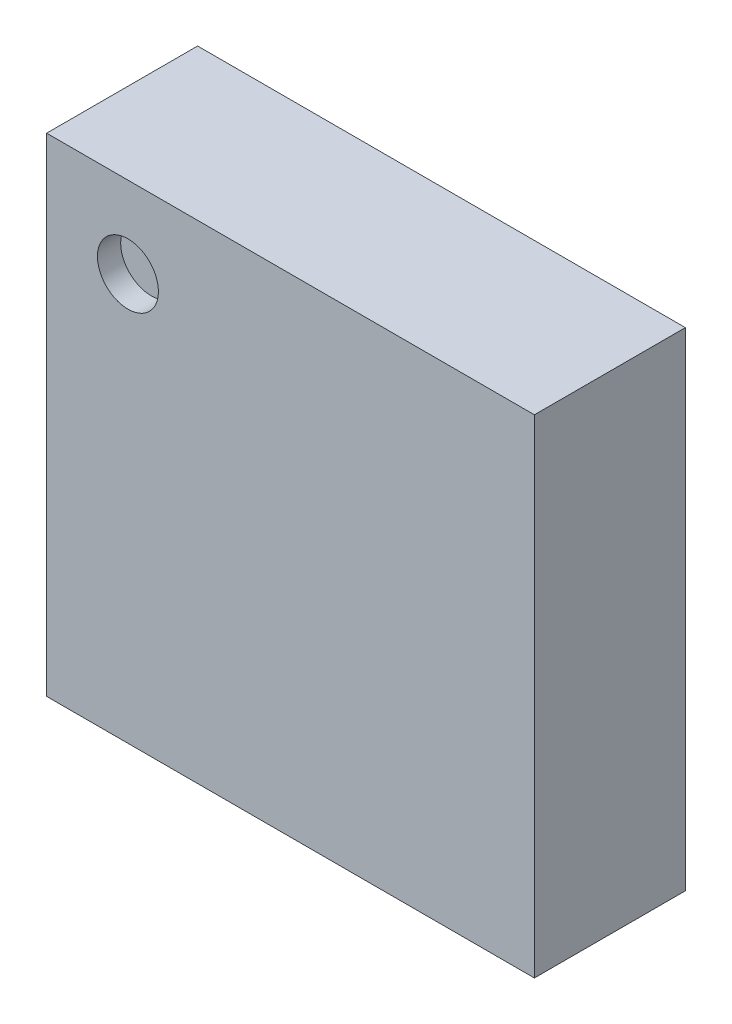
ISO-10303-21;
HEADER;
FILE_DESCRIPTION(('STEP AP214'),'2;1');
FILE_NAME('part.step','',(''),(''),'','','');
FILE_SCHEMA(('AUTOMOTIVE_DESIGN { 1 0 10303 214 1 1 1 1 }'));
ENDSEC;
DATA;
#1=APPLICATION_CONTEXT('core data for automotive mechanical design processes');
#2=APPLICATION_PROTOCOL_DEFINITION('international standard','automotive_design',2000,#1);
#3=PRODUCT_CONTEXT('',#1,'mechanical');
#4=PRODUCT('Part','Part','',(#3));
#5=PRODUCT_RELATED_PRODUCT_CATEGORY('part','',(#4));
#6=PRODUCT_DEFINITION_FORMATION('','',#4);
#7=PRODUCT_DEFINITION_CONTEXT('part definition',#1,'design');
#8=PRODUCT_DEFINITION('design','',#6,#7);
#9=PRODUCT_DEFINITION_SHAPE('','',#8);
#10=(LENGTH_UNIT() NAMED_UNIT(*) SI_UNIT(.MILLI.,.METRE.));
#11=(NAMED_UNIT(*) PLANE_ANGLE_UNIT() SI_UNIT($,.RADIAN.));
#12=(NAMED_UNIT(*) SI_UNIT($,.STERADIAN.) SOLID_ANGLE_UNIT());
#13=UNCERTAINTY_MEASURE_WITH_UNIT(LENGTH_MEASURE(1.E-05),#10,'distance_accuracy_value','');
#14=(GEOMETRIC_REPRESENTATION_CONTEXT(3) GLOBAL_UNCERTAINTY_ASSIGNED_CONTEXT((#13)) GLOBAL_UNIT_ASSIGNED_CONTEXT((#10,
#11,#12)) REPRESENTATION_CONTEXT('',''));
#15=CARTESIAN_POINT('',(0.,0.,0.));
#16=DIRECTION('',(0.,0.,1.));
#17=DIRECTION('',(1.,0.,0.));
#18=AXIS2_PLACEMENT_3D('',#15,#16,#17);
#19=CARTESIAN_POINT('',(0.35,1.75,0.55));
#20=DIRECTION('',(0.,0.,1.));
#21=DIRECTION('',(1.,0.,0.));
#22=AXIS2_PLACEMENT_3D('',#19,#20,#21);
#23=PLANE('',#22);
#24=CARTESIAN_POINT('',(0.35,1.75,0.55));
#25=DIRECTION('',(0.,0.,1.));
#26=DIRECTION('',(1.,0.,0.));
#27=AXIS2_PLACEMENT_3D('',#24,#25,#26);
#28=CIRCLE('',#27,0.13125);
#29=CARTESIAN_POINT('',(0.21875,1.75,0.55));
#30=VERTEX_POINT('',#29);
#31=EDGE_CURVE('E27',#30,#30,#28,.T.);
#32=ORIENTED_EDGE('',*,*,#31,.T.);
#33=EDGE_LOOP('',(#32));
#34=FACE_BOUND('',#33,.T.);
#35=ADVANCED_FACE('F16',(#34),#23,.T.);
#36=CARTESIAN_POINT('',(0.35,1.75,0.55));
#37=DIRECTION('',(0.,0.,1.));
#38=DIRECTION('',(1.,0.,0.));
#39=AXIS2_PLACEMENT_3D('',#36,#37,#38);
#40=CYLINDRICAL_SURFACE('',#39,0.13125);
#41=ORIENTED_EDGE('',*,*,#31,.F.);
#42=DIRECTION('',(0.,0.,1.));
#43=VECTOR('',#42,1.);
#44=CARTESIAN_POINT('',(0.21875,1.75,0.55));
#45=LINE('',#44,#43);
#46=CARTESIAN_POINT('',(0.21875,1.75,0.65));
#47=VERTEX_POINT('',#46);
#48=EDGE_CURVE('E11',#30,#47,#45,.T.);
#49=ORIENTED_EDGE('',*,*,#48,.T.);
#50=CARTESIAN_POINT('',(0.35,1.75,0.65));
#51=DIRECTION('',(0.,0.,1.));
#52=DIRECTION('',(1.,0.,0.));
#53=AXIS2_PLACEMENT_3D('',#50,#51,#52);
#54=CIRCLE('',#53,0.13125);
#55=EDGE_CURVE('E133',#47,#47,#54,.T.);
#56=ORIENTED_EDGE('',*,*,#55,.T.);
#57=ORIENTED_EDGE('',*,*,#48,.F.);
#58=EDGE_LOOP('',(#41,#49,#56,#57));
#59=FACE_BOUND('',#58,.T.);
#60=ADVANCED_FACE('F152',(#59),#40,.F.);
#61=CARTESIAN_POINT('',(2.1,0.,0.));
#62=DIRECTION('',(1.,0.,0.));
#63=DIRECTION('',(0.,1.,0.));
#64=AXIS2_PLACEMENT_3D('',#61,#62,#63);
#65=PLANE('',#64);
#66=DIRECTION('',(0.,0.,1.));
#67=VECTOR('',#66,1.);
#68=CARTESIAN_POINT('',(2.1,0.,0.));
#69=LINE('',#68,#67);
#70=CARTESIAN_POINT('',(2.1,0.,0.));
#71=VERTEX_POINT('',#70);
#72=CARTESIAN_POINT('',(2.1,0.,0.65));
#73=VERTEX_POINT('',#72);
#74=EDGE_CURVE('E88',#71,#73,#69,.T.);
#75=ORIENTED_EDGE('',*,*,#74,.F.);
#76=DIRECTION('',(0.,1.,0.));
#77=VECTOR('',#76,1.);
#78=CARTESIAN_POINT('',(2.1,0.,0.));
#79=LINE('',#78,#77);
#80=CARTESIAN_POINT('',(2.1,2.1,0.));
#81=VERTEX_POINT('',#80);
#82=EDGE_CURVE('E74',#71,#81,#79,.T.);
#83=ORIENTED_EDGE('',*,*,#82,.T.);
#84=DIRECTION('',(0.,0.,1.));
#85=VECTOR('',#84,1.);
#86=CARTESIAN_POINT('',(2.1,2.1,0.));
#87=LINE('',#86,#85);
#88=CARTESIAN_POINT('',(2.1,2.1,0.65));
#89=VERTEX_POINT('',#88);
#90=EDGE_CURVE('E85',#81,#89,#87,.T.);
#91=ORIENTED_EDGE('',*,*,#90,.T.);
#92=DIRECTION('',(0.,1.,0.));
#93=VECTOR('',#92,1.);
#94=CARTESIAN_POINT('',(2.1,0.,0.65));
#95=LINE('',#94,#93);
#96=EDGE_CURVE('E90',#73,#89,#95,.T.);
#97=ORIENTED_EDGE('',*,*,#96,.F.);
#98=EDGE_LOOP('',(#75,#83,#91,#97));
#99=FACE_BOUND('',#98,.T.);
#100=ADVANCED_FACE('F18',(#99),#65,.T.);
#101=CARTESIAN_POINT('',(0.,0.,0.));
#102=DIRECTION('',(0.,0.,1.));
#103=DIRECTION('',(1.,0.,0.));
#104=AXIS2_PLACEMENT_3D('',#101,#102,#103);
#105=PLANE('',#104);
#106=DIRECTION('',(0.,1.,0.));
#107=VECTOR('',#106,1.);
#108=CARTESIAN_POINT('',(0.,0.,0.));
#109=LINE('',#108,#107);
#110=CARTESIAN_POINT('',(0.,0.,0.));
#111=VERTEX_POINT('',#110);
#112=CARTESIAN_POINT('',(0.,2.1,0.));
#113=VERTEX_POINT('',#112);
#114=EDGE_CURVE('E100',#111,#113,#109,.T.);
#115=ORIENTED_EDGE('',*,*,#114,.T.);
#116=DIRECTION('',(1.,0.,0.));
#117=VECTOR('',#116,1.);
#118=CARTESIAN_POINT('',(0.,2.1,0.));
#119=LINE('',#118,#117);
#120=EDGE_CURVE('E81',#113,#81,#119,.T.);
#121=ORIENTED_EDGE('',*,*,#120,.T.);
#122=ORIENTED_EDGE('',*,*,#82,.F.);
#123=DIRECTION('',(1.,0.,0.));
#124=VECTOR('',#123,1.);
#125=CARTESIAN_POINT('',(0.,0.,0.));
#126=LINE('',#125,#124);
#127=EDGE_CURVE('E79',#111,#71,#126,.T.);
#128=ORIENTED_EDGE('',*,*,#127,.F.);
#129=EDGE_LOOP('',(#115,#121,#122,#128));
#130=FACE_BOUND('',#129,.T.);
#131=ADVANCED_FACE('F77',(#130),#105,.F.);
#132=CARTESIAN_POINT('',(0.,2.1,0.));
#133=DIRECTION('',(0.,1.,0.));
#134=DIRECTION('',(1.,0.,0.));
#135=AXIS2_PLACEMENT_3D('',#132,#133,#134);
#136=PLANE('',#135);
#137=ORIENTED_EDGE('',*,*,#120,.F.);
#138=DIRECTION('',(0.,0.,1.));
#139=VECTOR('',#138,1.);
#140=CARTESIAN_POINT('',(0.,2.1,0.));
#141=LINE('',#140,#139);
#142=CARTESIAN_POINT('',(0.,2.1,0.65));
#143=VERTEX_POINT('',#142);
#144=EDGE_CURVE('E106',#113,#143,#141,.T.);
#145=ORIENTED_EDGE('',*,*,#144,.T.);
#146=DIRECTION('',(1.,0.,0.));
#147=VECTOR('',#146,1.);
#148=CARTESIAN_POINT('',(0.,2.1,0.65));
#149=LINE('',#148,#147);
#150=EDGE_CURVE('E20',#143,#89,#149,.T.);
#151=ORIENTED_EDGE('',*,*,#150,.T.);
#152=ORIENTED_EDGE('',*,*,#90,.F.);
#153=EDGE_LOOP('',(#137,#145,#151,#152));
#154=FACE_BOUND('',#153,.T.);
#155=ADVANCED_FACE('F198',(#154),#136,.T.);
#156=CARTESIAN_POINT('',(0.,0.,0.65));
#157=DIRECTION('',(0.,0.,1.));
#158=DIRECTION('',(1.,0.,0.));
#159=AXIS2_PLACEMENT_3D('',#156,#157,#158);
#160=PLANE('',#159);
#161=ORIENTED_EDGE('',*,*,#55,.F.);
#162=EDGE_LOOP('',(#161));
#163=FACE_BOUND('',#162,.T.);
#164=DIRECTION('',(0.,1.,0.));
#165=VECTOR('',#164,1.);
#166=CARTESIAN_POINT('',(0.,0.,0.65));
#167=LINE('',#166,#165);
#168=CARTESIAN_POINT('',(0.,0.,0.65));
#169=VERTEX_POINT('',#168);
#170=EDGE_CURVE('E116',#169,#143,#167,.T.);
#171=ORIENTED_EDGE('',*,*,#170,.F.);
#172=DIRECTION('',(1.,0.,0.));
#173=VECTOR('',#172,1.);
#174=CARTESIAN_POINT('',(0.,0.,0.65));
#175=LINE('',#174,#173);
#176=EDGE_CURVE('E94',#169,#73,#175,.T.);
#177=ORIENTED_EDGE('',*,*,#176,.T.);
#178=ORIENTED_EDGE('',*,*,#96,.T.);
#179=ORIENTED_EDGE('',*,*,#150,.F.);
#180=EDGE_LOOP('',(#171,#177,#178,#179));
#181=FACE_BOUND('',#180,.T.);
#182=ADVANCED_FACE('F141',(#163,#181),#160,.T.);
#183=CARTESIAN_POINT('',(0.,0.,0.));
#184=DIRECTION('',(0.,1.,0.));
#185=DIRECTION('',(1.,0.,0.));
#186=AXIS2_PLACEMENT_3D('',#183,#184,#185);
#187=PLANE('',#186);
#188=ORIENTED_EDGE('',*,*,#127,.T.);
#189=ORIENTED_EDGE('',*,*,#74,.T.);
#190=ORIENTED_EDGE('',*,*,#176,.F.);
#191=DIRECTION('',(0.,0.,1.));
#192=VECTOR('',#191,1.);
#193=CARTESIAN_POINT('',(0.,0.,0.));
#194=LINE('',#193,#192);
#195=EDGE_CURVE('E98',#111,#169,#194,.T.);
#196=ORIENTED_EDGE('',*,*,#195,.F.);
#197=EDGE_LOOP('',(#188,#189,#190,#196));
#198=FACE_BOUND('',#197,.T.);
#199=ADVANCED_FACE('F96',(#198),#187,.F.);
#200=CARTESIAN_POINT('',(0.,0.,0.));
#201=DIRECTION('',(1.,0.,0.));
#202=DIRECTION('',(0.,1.,0.));
#203=AXIS2_PLACEMENT_3D('',#200,#201,#202);
#204=PLANE('',#203);
#205=ORIENTED_EDGE('',*,*,#195,.T.);
#206=ORIENTED_EDGE('',*,*,#170,.T.);
#207=ORIENTED_EDGE('',*,*,#144,.F.);
#208=ORIENTED_EDGE('',*,*,#114,.F.);
#209=EDGE_LOOP('',(#205,#206,#207,#208));
#210=FACE_BOUND('',#209,.T.);
#211=ADVANCED_FACE('F142',(#210),#204,.F.);
#212=CLOSED_SHELL('',(#35,#60,#100,#131,#155,#182,#199,#211));
#213=MANIFOLD_SOLID_BREP('B1',#212);
#214=ADVANCED_BREP_SHAPE_REPRESENTATION('',(#18,#213),#14);
#215=SHAPE_DEFINITION_REPRESENTATION(#9,#214);
ENDSEC;
END-ISO-10303-21;
